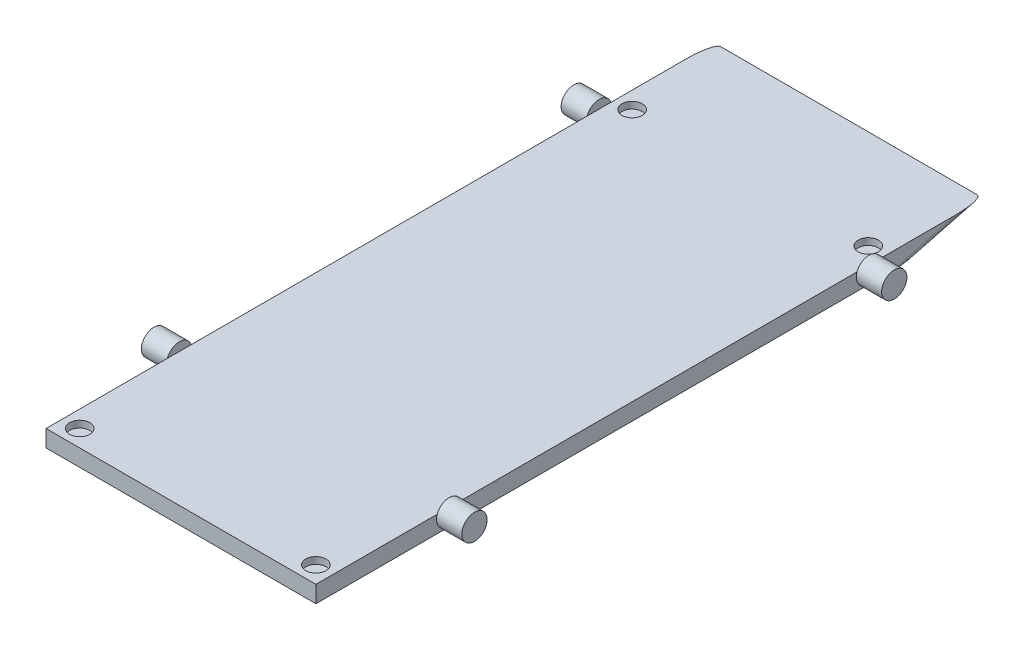
ISO-10303-21;
HEADER;
FILE_DESCRIPTION(('STEP AP214'),'2;1');
FILE_NAME('part.step','',(''),(''),'','','');
FILE_SCHEMA(('AUTOMOTIVE_DESIGN { 1 0 10303 214 1 1 1 1 }'));
ENDSEC;
DATA;
#1=APPLICATION_CONTEXT('core data for automotive mechanical design processes');
#2=APPLICATION_PROTOCOL_DEFINITION('international standard','automotive_design',2000,#1);
#3=PRODUCT_CONTEXT('',#1,'mechanical');
#4=PRODUCT('Part','Part','',(#3));
#5=PRODUCT_RELATED_PRODUCT_CATEGORY('part','',(#4));
#6=PRODUCT_DEFINITION_FORMATION('','',#4);
#7=PRODUCT_DEFINITION_CONTEXT('part definition',#1,'design');
#8=PRODUCT_DEFINITION('design','',#6,#7);
#9=PRODUCT_DEFINITION_SHAPE('','',#8);
#10=(LENGTH_UNIT() NAMED_UNIT(*) SI_UNIT(.MILLI.,.METRE.));
#11=(NAMED_UNIT(*) PLANE_ANGLE_UNIT() SI_UNIT($,.RADIAN.));
#12=(NAMED_UNIT(*) SI_UNIT($,.STERADIAN.) SOLID_ANGLE_UNIT());
#13=UNCERTAINTY_MEASURE_WITH_UNIT(LENGTH_MEASURE(1.E-05),#10,'distance_accuracy_value','');
#14=(GEOMETRIC_REPRESENTATION_CONTEXT(3) GLOBAL_UNCERTAINTY_ASSIGNED_CONTEXT((#13)) GLOBAL_UNIT_ASSIGNED_CONTEXT((#10,
#11,#12)) REPRESENTATION_CONTEXT('',''));
#15=CARTESIAN_POINT('',(0.,0.,0.));
#16=DIRECTION('',(0.,0.,1.));
#17=DIRECTION('',(1.,0.,0.));
#18=AXIS2_PLACEMENT_3D('',#15,#16,#17);
#19=CARTESIAN_POINT('',(40.,5.,-99.));
#20=DIRECTION('',(-1.,0.,0.));
#21=DIRECTION('',(0.,0.,1.));
#22=AXIS2_PLACEMENT_3D('',#19,#20,#21);
#23=PLANE('',#22);
#24=DIRECTION('',(0.,0.,-1.));
#25=VECTOR('',#24,1.);
#26=CARTESIAN_POINT('',(40.,5.,-99.));
#27=LINE('',#26,#25);
#28=CARTESIAN_POINT('',(40.,5.,55.9644660940673));
#29=VERTEX_POINT('',#28);
#30=CARTESIAN_POINT('',(40.,5.,-61.3933719084473));
#31=VERTEX_POINT('',#30);
#32=EDGE_CURVE('E205',#29,#31,#27,.T.);
#33=ORIENTED_EDGE('',*,*,#32,.F.);
#34=CARTESIAN_POINT('',(40.,3.75,59.5));
#35=DIRECTION('',(-1.,0.,0.));
#36=DIRECTION('',(0.,0.,1.));
#37=AXIS2_PLACEMENT_3D('',#34,#35,#36);
#38=CIRCLE('',#37,3.74999999999999);
#39=CARTESIAN_POINT('',(40.,0.,59.5));
#40=VERTEX_POINT('',#39);
#41=EDGE_CURVE('E184',#29,#40,#38,.T.);
#42=ORIENTED_EDGE('',*,*,#41,.T.);
#43=DIRECTION('',(0.,0.,-1.));
#44=VECTOR('',#43,1.);
#45=CARTESIAN_POINT('',(40.,0.,-99.));
#46=LINE('',#45,#44);
#47=CARTESIAN_POINT('',(40.,0.,-64.92890581438));
#48=VERTEX_POINT('',#47);
#49=EDGE_CURVE('E286',#40,#48,#46,.T.);
#50=ORIENTED_EDGE('',*,*,#49,.T.);
#51=CARTESIAN_POINT('',(40.,3.75,-64.92890581438));
#52=DIRECTION('',(-1.,0.,0.));
#53=DIRECTION('',(0.,0.,1.));
#54=AXIS2_PLACEMENT_3D('',#51,#52,#53);
#55=CIRCLE('',#54,3.75000000000001);
#56=EDGE_CURVE('E334',#48,#31,#55,.T.);
#57=ORIENTED_EDGE('',*,*,#56,.T.);
#58=EDGE_LOOP('',(#33,#42,#50,#57));
#59=FACE_BOUND('',#58,.T.);
#60=ADVANCED_FACE('F78',(#59),#23,.F.);
#61=CARTESIAN_POINT('',(40.,0.,-71.7485632957322));
#62=VERTEX_POINT('',#61);
#63=EDGE_CURVE('E279',#48,#62,#46,.T.);
#64=ORIENTED_EDGE('',*,*,#63,.T.);
#65=DIRECTION('',(0.,0.250993863675924,-0.967988677824814));
#66=VECTOR('',#65,1.);
#67=CARTESIAN_POINT('',(40.,6.93597735564963,-98.4980122726482));
#68=LINE('',#67,#66);
#69=CARTESIAN_POINT('',(40.,5.,-91.0316777043508));
#70=VERTEX_POINT('',#69);
#71=EDGE_CURVE('E251',#62,#70,#68,.T.);
#72=ORIENTED_EDGE('',*,*,#71,.T.);
#73=CARTESIAN_POINT('',(40.,5.,-68.4644397203128));
#74=VERTEX_POINT('',#73);
#75=EDGE_CURVE('E215',#74,#70,#27,.T.);
#76=ORIENTED_EDGE('',*,*,#75,.F.);
#77=EDGE_CURVE('E252',#74,#48,#55,.T.);
#78=ORIENTED_EDGE('',*,*,#77,.T.);
#79=EDGE_LOOP('',(#64,#72,#76,#78));
#80=FACE_BOUND('',#79,.T.);
#81=ADVANCED_FACE('F284',(#80),#23,.F.);
#82=CARTESIAN_POINT('',(-40.,5.,-99.));
#83=DIRECTION('',(1.,0.,0.));
#84=DIRECTION('',(0.,0.,-1.));
#85=AXIS2_PLACEMENT_3D('',#82,#83,#84);
#86=PLANE('',#85);
#87=CARTESIAN_POINT('',(-40.,3.75,-64.92890581438));
#88=DIRECTION('',(-1.,0.,0.));
#89=DIRECTION('',(0.,0.,1.));
#90=AXIS2_PLACEMENT_3D('',#87,#88,#89);
#91=CIRCLE('',#90,3.75000000000001);
#92=CARTESIAN_POINT('',(-40.,0.,-64.92890581438));
#93=VERTEX_POINT('',#92);
#94=CARTESIAN_POINT('',(-40.,5.,-61.3933719084473));
#95=VERTEX_POINT('',#94);
#96=EDGE_CURVE('E364',#93,#95,#91,.T.);
#97=ORIENTED_EDGE('',*,*,#96,.F.);
#98=DIRECTION('',(0.,0.,1.));
#99=VECTOR('',#98,1.);
#100=CARTESIAN_POINT('',(-40.,0.,-99.));
#101=LINE('',#100,#99);
#102=CARTESIAN_POINT('',(-40.,0.,59.5));
#103=VERTEX_POINT('',#102);
#104=EDGE_CURVE('E236',#93,#103,#101,.T.);
#105=ORIENTED_EDGE('',*,*,#104,.T.);
#106=CARTESIAN_POINT('',(-40.,3.75,59.5));
#107=DIRECTION('',(-1.,0.,0.));
#108=DIRECTION('',(0.,0.,1.));
#109=AXIS2_PLACEMENT_3D('',#106,#107,#108);
#110=CIRCLE('',#109,3.74999999999999);
#111=CARTESIAN_POINT('',(-40.,5.,55.9644660940673));
#112=VERTEX_POINT('',#111);
#113=EDGE_CURVE('E341',#112,#103,#110,.T.);
#114=ORIENTED_EDGE('',*,*,#113,.F.);
#115=DIRECTION('',(0.,0.,1.));
#116=VECTOR('',#115,1.);
#117=CARTESIAN_POINT('',(-40.,5.,-99.));
#118=LINE('',#117,#116);
#119=EDGE_CURVE('E301',#95,#112,#118,.T.);
#120=ORIENTED_EDGE('',*,*,#119,.F.);
#121=EDGE_LOOP('',(#97,#105,#114,#120));
#122=FACE_BOUND('',#121,.T.);
#123=ADVANCED_FACE('F432',(#122),#86,.F.);
#124=CARTESIAN_POINT('',(-40.,5.,-91.0316777043508));
#125=VERTEX_POINT('',#124);
#126=CARTESIAN_POINT('',(-40.,5.,-68.4644397203128));
#127=VERTEX_POINT('',#126);
#128=EDGE_CURVE('E294',#125,#127,#118,.T.);
#129=ORIENTED_EDGE('',*,*,#128,.F.);
#130=DIRECTION('',(0.,0.250993863675924,-0.967988677824814));
#131=VECTOR('',#130,1.);
#132=CARTESIAN_POINT('',(-40.,6.93597735564963,-98.4980122726482));
#133=LINE('',#132,#131);
#134=CARTESIAN_POINT('',(-40.,0.,-71.7485632957322));
#135=VERTEX_POINT('',#134);
#136=EDGE_CURVE('E12',#125,#135,#133,.F.);
#137=ORIENTED_EDGE('',*,*,#136,.T.);
#138=EDGE_CURVE('E228',#135,#93,#101,.T.);
#139=ORIENTED_EDGE('',*,*,#138,.T.);
#140=EDGE_CURVE('E299',#127,#93,#91,.T.);
#141=ORIENTED_EDGE('',*,*,#140,.F.);
#142=EDGE_LOOP('',(#129,#137,#139,#141));
#143=FACE_BOUND('',#142,.T.);
#144=ADVANCED_FACE('F297',(#143),#86,.F.);
#145=CARTESIAN_POINT('',(40.,0.,99.));
#146=VERTEX_POINT('',#145);
#147=EDGE_CURVE('E195',#146,#40,#46,.T.);
#148=ORIENTED_EDGE('',*,*,#147,.T.);
#149=CARTESIAN_POINT('',(40.,5.,63.0355339059327));
#150=VERTEX_POINT('',#149);
#151=EDGE_CURVE('E182',#40,#150,#38,.T.);
#152=ORIENTED_EDGE('',*,*,#151,.T.);
#153=CARTESIAN_POINT('',(40.,5.,99.));
#154=VERTEX_POINT('',#153);
#155=EDGE_CURVE('E193',#154,#150,#27,.T.);
#156=ORIENTED_EDGE('',*,*,#155,.F.);
#157=DIRECTION('',(0.,-1.,0.));
#158=VECTOR('',#157,1.);
#159=CARTESIAN_POINT('',(40.,5.,99.));
#160=LINE('',#159,#158);
#161=EDGE_CURVE('E241',#154,#146,#160,.T.);
#162=ORIENTED_EDGE('',*,*,#161,.T.);
#163=EDGE_LOOP('',(#148,#152,#156,#162));
#164=FACE_BOUND('',#163,.T.);
#165=ADVANCED_FACE('F191',(#164),#23,.F.);
#166=CARTESIAN_POINT('',(-40.,5.,63.0355339059327));
#167=VERTEX_POINT('',#166);
#168=EDGE_CURVE('E247',#103,#167,#110,.T.);
#169=ORIENTED_EDGE('',*,*,#168,.F.);
#170=CARTESIAN_POINT('',(-40.,0.,99.));
#171=VERTEX_POINT('',#170);
#172=EDGE_CURVE('E238',#103,#171,#101,.T.);
#173=ORIENTED_EDGE('',*,*,#172,.T.);
#174=DIRECTION('',(0.,-1.,0.));
#175=VECTOR('',#174,1.);
#176=CARTESIAN_POINT('',(-40.,5.,99.));
#177=LINE('',#176,#175);
#178=CARTESIAN_POINT('',(-40.,5.,99.));
#179=VERTEX_POINT('',#178);
#180=EDGE_CURVE('E244',#179,#171,#177,.T.);
#181=ORIENTED_EDGE('',*,*,#180,.F.);
#182=EDGE_CURVE('E213',#167,#179,#118,.T.);
#183=ORIENTED_EDGE('',*,*,#182,.F.);
#184=EDGE_LOOP('',(#169,#173,#181,#183));
#185=FACE_BOUND('',#184,.T.);
#186=ADVANCED_FACE('F321',(#185),#86,.F.);
#187=CARTESIAN_POINT('',(-40.,5.,99.));
#188=DIRECTION('',(0.,0.,-1.));
#189=DIRECTION('',(-1.,0.,0.));
#190=AXIS2_PLACEMENT_3D('',#187,#188,#189);
#191=PLANE('',#190);
#192=DIRECTION('',(1.,0.,0.));
#193=VECTOR('',#192,1.);
#194=CARTESIAN_POINT('',(-40.,0.,99.));
#195=LINE('',#194,#193);
#196=EDGE_CURVE('E223',#171,#146,#195,.T.);
#197=ORIENTED_EDGE('',*,*,#196,.T.);
#198=ORIENTED_EDGE('',*,*,#161,.F.);
#199=DIRECTION('',(1.,0.,0.));
#200=VECTOR('',#199,1.);
#201=CARTESIAN_POINT('',(-40.,5.,99.));
#202=LINE('',#201,#200);
#203=EDGE_CURVE('E201',#179,#154,#202,.T.);
#204=ORIENTED_EDGE('',*,*,#203,.F.);
#205=ORIENTED_EDGE('',*,*,#180,.T.);
#206=EDGE_LOOP('',(#197,#198,#204,#205));
#207=FACE_BOUND('',#206,.T.);
#208=ADVANCED_FACE('F323',(#207),#191,.F.);
#209=CARTESIAN_POINT('',(0.,5.,0.));
#210=DIRECTION('',(0.,1.,0.));
#211=DIRECTION('',(0.,0.,1.));
#212=AXIS2_PLACEMENT_3D('',#209,#210,#211);
#213=PLANE('',#212);
#214=CARTESIAN_POINT('',(35.,5.,-69.7168855913814));
#215=DIRECTION('',(0.,1.,0.));
#216=DIRECTION('',(0.,0.,1.));
#217=AXIS2_PLACEMENT_3D('',#214,#215,#216);
#218=CIRCLE('',#217,3.);
#219=CARTESIAN_POINT('',(35.,5.,-66.7168855913814));
#220=VERTEX_POINT('',#219);
#221=EDGE_CURVE('E374',#220,#220,#218,.T.);
#222=ORIENTED_EDGE('',*,*,#221,.F.);
#223=EDGE_LOOP('',(#222));
#224=FACE_BOUND('',#223,.T.);
#225=CARTESIAN_POINT('',(-35.,5.,94.));
#226=DIRECTION('',(0.,1.,0.));
#227=DIRECTION('',(0.,0.,1.));
#228=AXIS2_PLACEMENT_3D('',#225,#226,#227);
#229=CIRCLE('',#228,3.);
#230=CARTESIAN_POINT('',(-35.,5.,97.));
#231=VERTEX_POINT('',#230);
#232=EDGE_CURVE('E382',#231,#231,#229,.T.);
#233=ORIENTED_EDGE('',*,*,#232,.F.);
#234=EDGE_LOOP('',(#233));
#235=FACE_BOUND('',#234,.T.);
#236=CARTESIAN_POINT('',(35.,5.,94.));
#237=DIRECTION('',(0.,1.,0.));
#238=DIRECTION('',(0.,0.,1.));
#239=AXIS2_PLACEMENT_3D('',#236,#237,#238);
#240=CIRCLE('',#239,3.);
#241=CARTESIAN_POINT('',(35.,5.,97.));
#242=VERTEX_POINT('',#241);
#243=EDGE_CURVE('E383',#242,#242,#240,.T.);
#244=ORIENTED_EDGE('',*,*,#243,.F.);
#245=EDGE_LOOP('',(#244));
#246=FACE_BOUND('',#245,.T.);
#247=CARTESIAN_POINT('',(-35.,5.,-69.7168855913814));
#248=DIRECTION('',(0.,1.,0.));
#249=DIRECTION('',(0.,0.,1.));
#250=AXIS2_PLACEMENT_3D('',#247,#248,#249);
#251=CIRCLE('',#250,3.);
#252=CARTESIAN_POINT('',(-35.,5.,-66.7168855913814));
#253=VERTEX_POINT('',#252);
#254=EDGE_CURVE('E370',#253,#253,#251,.T.);
#255=ORIENTED_EDGE('',*,*,#254,.F.);
#256=EDGE_LOOP('',(#255));
#257=FACE_BOUND('',#256,.T.);
#258=ORIENTED_EDGE('',*,*,#75,.T.);
#259=CARTESIAN_POINT('',(38.,5.,-91.0316777043508));
#260=DIRECTION('',(0.,1.,0.));
#261=DIRECTION('',(0.,0.,-1.));
#262=AXIS2_PLACEMENT_3D('',#259,#260,#261);
#263=ELLIPSE('',#262,7.9683222956492,2.);
#264=CARTESIAN_POINT('',(38.,5.,-99.));
#265=VERTEX_POINT('',#264);
#266=EDGE_CURVE('E259',#70,#265,#263,.T.);
#267=ORIENTED_EDGE('',*,*,#266,.T.);
#268=DIRECTION('',(-1.,0.,0.));
#269=VECTOR('',#268,1.);
#270=CARTESIAN_POINT('',(-40.,5.,-99.));
#271=LINE('',#270,#269);
#272=CARTESIAN_POINT('',(-38.,5.,-99.));
#273=VERTEX_POINT('',#272);
#274=EDGE_CURVE('E204',#265,#273,#271,.T.);
#275=ORIENTED_EDGE('',*,*,#274,.T.);
#276=CARTESIAN_POINT('',(-38.,5.,-91.0316777043508));
#277=DIRECTION('',(0.,1.,0.));
#278=DIRECTION('',(0.,0.,-1.));
#279=AXIS2_PLACEMENT_3D('',#276,#277,#278);
#280=ELLIPSE('',#279,7.9683222956492,2.);
#281=EDGE_CURVE('E256',#273,#125,#280,.T.);
#282=ORIENTED_EDGE('',*,*,#281,.T.);
#283=ORIENTED_EDGE('',*,*,#128,.T.);
#284=DIRECTION('',(0.,0.,1.));
#285=VECTOR('',#284,1.);
#286=CARTESIAN_POINT('',(-40.,5.,0.));
#287=LINE('',#286,#285);
#288=EDGE_CURVE('E743',#127,#95,#287,.T.);
#289=ORIENTED_EDGE('',*,*,#288,.T.);
#290=ORIENTED_EDGE('',*,*,#119,.T.);
#291=EDGE_CURVE('E303',#112,#167,#118,.T.);
#292=ORIENTED_EDGE('',*,*,#291,.T.);
#293=ORIENTED_EDGE('',*,*,#182,.T.);
#294=ORIENTED_EDGE('',*,*,#203,.T.);
#295=ORIENTED_EDGE('',*,*,#155,.T.);
#296=DIRECTION('',(0.,0.,-1.));
#297=VECTOR('',#296,1.);
#298=CARTESIAN_POINT('',(40.,5.,0.));
#299=LINE('',#298,#297);
#300=EDGE_CURVE('E168',#150,#29,#299,.T.);
#301=ORIENTED_EDGE('',*,*,#300,.T.);
#302=ORIENTED_EDGE('',*,*,#32,.T.);
#303=EDGE_CURVE('E207',#31,#74,#27,.T.);
#304=ORIENTED_EDGE('',*,*,#303,.T.);
#305=EDGE_LOOP('',(#258,#267,#275,#282,#283,#289,#290,#292,#293,#294,#295,#301,#302,#304));
#306=FACE_BOUND('',#305,.T.);
#307=ADVANCED_FACE('F199',(#224,#235,#246,#257,#306),#213,.T.);
#308=CARTESIAN_POINT('',(0.,0.,0.));
#309=DIRECTION('',(0.,1.,0.));
#310=DIRECTION('',(0.,0.,1.));
#311=AXIS2_PLACEMENT_3D('',#308,#309,#310);
#312=PLANE('',#311);
#313=DIRECTION('',(1.,0.,0.));
#314=VECTOR('',#313,1.);
#315=CARTESIAN_POINT('',(0.,0.,-79.7168855913814));
#316=LINE('',#315,#314);
#317=CARTESIAN_POINT('',(-38.,0.,-79.7168855913814));
#318=VERTEX_POINT('',#317);
#319=CARTESIAN_POINT('',(38.,0.,-79.7168855913814));
#320=VERTEX_POINT('',#319);
#321=EDGE_CURVE('E248',#318,#320,#316,.T.);
#322=ORIENTED_EDGE('',*,*,#321,.T.);
#323=CARTESIAN_POINT('',(38.,0.,-71.7485632957322));
#324=DIRECTION('',(0.,1.,0.));
#325=DIRECTION('',(0.,0.,-1.));
#326=AXIS2_PLACEMENT_3D('',#323,#324,#325);
#327=ELLIPSE('',#326,7.9683222956492,2.);
#328=EDGE_CURVE('E87',#320,#62,#327,.F.);
#329=ORIENTED_EDGE('',*,*,#328,.T.);
#330=ORIENTED_EDGE('',*,*,#63,.F.);
#331=ORIENTED_EDGE('',*,*,#49,.F.);
#332=ORIENTED_EDGE('',*,*,#147,.F.);
#333=ORIENTED_EDGE('',*,*,#196,.F.);
#334=ORIENTED_EDGE('',*,*,#172,.F.);
#335=ORIENTED_EDGE('',*,*,#104,.F.);
#336=ORIENTED_EDGE('',*,*,#138,.F.);
#337=CARTESIAN_POINT('',(-38.,0.,-71.7485632957322));
#338=DIRECTION('',(0.,1.,0.));
#339=DIRECTION('',(0.,0.,-1.));
#340=AXIS2_PLACEMENT_3D('',#337,#338,#339);
#341=ELLIPSE('',#340,7.9683222956492,2.);
#342=EDGE_CURVE('E268',#135,#318,#341,.F.);
#343=ORIENTED_EDGE('',*,*,#342,.T.);
#344=EDGE_LOOP('',(#322,#329,#330,#331,#332,#333,#334,#335,#336,#343));
#345=FACE_BOUND('',#344,.T.);
#346=ADVANCED_FACE('F277',(#345),#312,.F.);
#347=CARTESIAN_POINT('',(-40.,0.,0.));
#348=DIRECTION('',(-1.,0.,0.));
#349=DIRECTION('',(0.,0.,1.));
#350=AXIS2_PLACEMENT_3D('',#347,#348,#349);
#351=PLANE('',#350);
#352=ORIENTED_EDGE('',*,*,#291,.F.);
#353=EDGE_CURVE('E348',#167,#112,#110,.T.);
#354=ORIENTED_EDGE('',*,*,#353,.F.);
#355=EDGE_LOOP('',(#352,#354));
#356=FACE_BOUND('',#355,.T.);
#357=ADVANCED_FACE('F447',(#356),#351,.F.);
#358=CARTESIAN_POINT('',(-47.5,3.75,59.5));
#359=DIRECTION('',(1.,0.,0.));
#360=DIRECTION('',(0.,0.,-1.));
#361=AXIS2_PLACEMENT_3D('',#358,#359,#360);
#362=CYLINDRICAL_SURFACE('',#361,3.74999999999999);
#363=CARTESIAN_POINT('',(-47.5,3.75,59.5));
#364=DIRECTION('',(-1.,0.,0.));
#365=DIRECTION('',(0.,0.,1.));
#366=AXIS2_PLACEMENT_3D('',#363,#364,#365);
#367=CIRCLE('',#366,3.74999999999999);
#368=CARTESIAN_POINT('',(-47.5,3.75,63.25));
#369=VERTEX_POINT('',#368);
#370=EDGE_CURVE('E287',#369,#369,#367,.T.);
#371=ORIENTED_EDGE('',*,*,#370,.F.);
#372=EDGE_LOOP('',(#371));
#373=FACE_BOUND('',#372,.T.);
#374=ORIENTED_EDGE('',*,*,#353,.T.);
#375=ORIENTED_EDGE('',*,*,#113,.T.);
#376=ORIENTED_EDGE('',*,*,#168,.T.);
#377=EDGE_LOOP('',(#374,#375,#376));
#378=FACE_BOUND('',#377,.T.);
#379=ADVANCED_FACE('F448',(#373,#378),#362,.T.);
#380=CARTESIAN_POINT('',(-47.5,0.,0.));
#381=DIRECTION('',(-1.,0.,0.));
#382=DIRECTION('',(0.,0.,1.));
#383=AXIS2_PLACEMENT_3D('',#380,#381,#382);
#384=PLANE('',#383);
#385=ORIENTED_EDGE('',*,*,#370,.T.);
#386=EDGE_LOOP('',(#385));
#387=FACE_BOUND('',#386,.T.);
#388=ADVANCED_FACE('F452',(#387),#384,.T.);
#389=CARTESIAN_POINT('',(-40.,0.,0.));
#390=DIRECTION('',(-1.,0.,0.));
#391=DIRECTION('',(0.,0.,1.));
#392=AXIS2_PLACEMENT_3D('',#389,#390,#391);
#393=PLANE('',#392);
#394=ORIENTED_EDGE('',*,*,#288,.F.);
#395=EDGE_CURVE('E738',#95,#127,#91,.T.);
#396=ORIENTED_EDGE('',*,*,#395,.F.);
#397=EDGE_LOOP('',(#394,#396));
#398=FACE_BOUND('',#397,.T.);
#399=ADVANCED_FACE('F459',(#398),#393,.F.);
#400=CARTESIAN_POINT('',(-47.5,3.75,-64.92890581438));
#401=DIRECTION('',(1.,0.,0.));
#402=DIRECTION('',(0.,0.,-1.));
#403=AXIS2_PLACEMENT_3D('',#400,#401,#402);
#404=CYLINDRICAL_SURFACE('',#403,3.75000000000001);
#405=ORIENTED_EDGE('',*,*,#395,.T.);
#406=ORIENTED_EDGE('',*,*,#140,.T.);
#407=ORIENTED_EDGE('',*,*,#96,.T.);
#408=EDGE_LOOP('',(#405,#406,#407));
#409=FACE_BOUND('',#408,.T.);
#410=CARTESIAN_POINT('',(-47.5,3.75,-64.92890581438));
#411=DIRECTION('',(-1.,0.,0.));
#412=DIRECTION('',(0.,0.,1.));
#413=AXIS2_PLACEMENT_3D('',#410,#411,#412);
#414=CIRCLE('',#413,3.75000000000001);
#415=CARTESIAN_POINT('',(-47.5,3.75,-61.17890581438));
#416=VERTEX_POINT('',#415);
#417=EDGE_CURVE('E358',#416,#416,#414,.T.);
#418=ORIENTED_EDGE('',*,*,#417,.F.);
#419=EDGE_LOOP('',(#418));
#420=FACE_BOUND('',#419,.T.);
#421=ADVANCED_FACE('F461',(#409,#420),#404,.T.);
#422=CARTESIAN_POINT('',(-47.5,0.,0.));
#423=DIRECTION('',(-1.,0.,0.));
#424=DIRECTION('',(0.,0.,1.));
#425=AXIS2_PLACEMENT_3D('',#422,#423,#424);
#426=PLANE('',#425);
#427=ORIENTED_EDGE('',*,*,#417,.T.);
#428=EDGE_LOOP('',(#427));
#429=FACE_BOUND('',#428,.T.);
#430=ADVANCED_FACE('F462',(#429),#426,.T.);
#431=CARTESIAN_POINT('',(47.5,3.75,-64.92890581438));
#432=DIRECTION('',(-1.,0.,0.));
#433=DIRECTION('',(0.,0.,1.));
#434=AXIS2_PLACEMENT_3D('',#431,#432,#433);
#435=CYLINDRICAL_SURFACE('',#434,3.75000000000001);
#436=EDGE_CURVE('E176',#31,#74,#55,.T.);
#437=ORIENTED_EDGE('',*,*,#436,.F.);
#438=ORIENTED_EDGE('',*,*,#56,.F.);
#439=ORIENTED_EDGE('',*,*,#77,.F.);
#440=EDGE_LOOP('',(#437,#438,#439));
#441=FACE_BOUND('',#440,.T.);
#442=CARTESIAN_POINT('',(47.5,3.75,-64.92890581438));
#443=DIRECTION('',(-1.,0.,0.));
#444=DIRECTION('',(0.,0.,1.));
#445=AXIS2_PLACEMENT_3D('',#442,#443,#444);
#446=CIRCLE('',#445,3.75000000000001);
#447=CARTESIAN_POINT('',(47.5,3.75,-61.17890581438));
#448=VERTEX_POINT('',#447);
#449=EDGE_CURVE('E352',#448,#448,#446,.T.);
#450=ORIENTED_EDGE('',*,*,#449,.T.);
#451=EDGE_LOOP('',(#450));
#452=FACE_BOUND('',#451,.T.);
#453=ADVANCED_FACE('F337',(#441,#452),#435,.T.);
#454=CARTESIAN_POINT('',(47.5,0.,0.));
#455=DIRECTION('',(1.,0.,0.));
#456=DIRECTION('',(0.,0.,1.));
#457=AXIS2_PLACEMENT_3D('',#454,#455,#456);
#458=PLANE('',#457);
#459=ORIENTED_EDGE('',*,*,#449,.F.);
#460=EDGE_LOOP('',(#459));
#461=FACE_BOUND('',#460,.T.);
#462=ADVANCED_FACE('F472',(#461),#458,.T.);
#463=CARTESIAN_POINT('',(40.,0.,0.));
#464=DIRECTION('',(1.,0.,0.));
#465=DIRECTION('',(0.,0.,1.));
#466=AXIS2_PLACEMENT_3D('',#463,#464,#465);
#467=PLANE('',#466);
#468=ORIENTED_EDGE('',*,*,#303,.F.);
#469=ORIENTED_EDGE('',*,*,#436,.T.);
#470=EDGE_LOOP('',(#468,#469));
#471=FACE_BOUND('',#470,.T.);
#472=ADVANCED_FACE('F473',(#471),#467,.F.);
#473=CARTESIAN_POINT('',(47.5,3.75,59.5));
#474=DIRECTION('',(-1.,0.,0.));
#475=DIRECTION('',(0.,0.,1.));
#476=AXIS2_PLACEMENT_3D('',#473,#474,#475);
#477=CYLINDRICAL_SURFACE('',#476,3.74999999999999);
#478=CARTESIAN_POINT('',(47.5,3.75,59.5));
#479=DIRECTION('',(-1.,0.,0.));
#480=DIRECTION('',(0.,0.,1.));
#481=AXIS2_PLACEMENT_3D('',#478,#479,#480);
#482=CIRCLE('',#481,3.74999999999999);
#483=CARTESIAN_POINT('',(47.5,3.75,63.25));
#484=VERTEX_POINT('',#483);
#485=EDGE_CURVE('E177',#484,#484,#482,.T.);
#486=ORIENTED_EDGE('',*,*,#485,.T.);
#487=EDGE_LOOP('',(#486));
#488=FACE_BOUND('',#487,.T.);
#489=EDGE_CURVE('E171',#150,#29,#38,.T.);
#490=ORIENTED_EDGE('',*,*,#489,.F.);
#491=ORIENTED_EDGE('',*,*,#151,.F.);
#492=ORIENTED_EDGE('',*,*,#41,.F.);
#493=EDGE_LOOP('',(#490,#491,#492));
#494=FACE_BOUND('',#493,.T.);
#495=ADVANCED_FACE('F181',(#488,#494),#477,.T.);
#496=CARTESIAN_POINT('',(47.5,0.,0.));
#497=DIRECTION('',(1.,0.,0.));
#498=DIRECTION('',(0.,0.,1.));
#499=AXIS2_PLACEMENT_3D('',#496,#497,#498);
#500=PLANE('',#499);
#501=ORIENTED_EDGE('',*,*,#485,.F.);
#502=EDGE_LOOP('',(#501));
#503=FACE_BOUND('',#502,.T.);
#504=ADVANCED_FACE('F481',(#503),#500,.T.);
#505=CARTESIAN_POINT('',(40.,0.,0.));
#506=DIRECTION('',(1.,0.,0.));
#507=DIRECTION('',(0.,0.,1.));
#508=AXIS2_PLACEMENT_3D('',#505,#506,#507);
#509=PLANE('',#508);
#510=ORIENTED_EDGE('',*,*,#300,.F.);
#511=ORIENTED_EDGE('',*,*,#489,.T.);
#512=EDGE_LOOP('',(#510,#511));
#513=FACE_BOUND('',#512,.T.);
#514=ADVANCED_FACE('F170',(#513),#509,.F.);
#515=CARTESIAN_POINT('',(47.5,5.,-99.));
#516=DIRECTION('',(0.,0.967988677824814,0.250993863675924));
#517=DIRECTION('',(0.,-0.250993863675924,0.967988677824814));
#518=AXIS2_PLACEMENT_3D('',#515,#516,#517);
#519=PLANE('',#518);
#520=ORIENTED_EDGE('',*,*,#274,.F.);
#521=DIRECTION('',(0.,0.250993863675924,-0.967988677824814));
#522=VECTOR('',#521,1.);
#523=CARTESIAN_POINT('',(38.,5.,-99.));
#524=LINE('',#523,#522);
#525=EDGE_CURVE('E100',#265,#320,#524,.F.);
#526=ORIENTED_EDGE('',*,*,#525,.T.);
#527=ORIENTED_EDGE('',*,*,#321,.F.);
#528=DIRECTION('',(0.,0.250993863675924,-0.967988677824814));
#529=VECTOR('',#528,1.);
#530=CARTESIAN_POINT('',(-38.,5.,-99.));
#531=LINE('',#530,#529);
#532=EDGE_CURVE('E262',#318,#273,#531,.T.);
#533=ORIENTED_EDGE('',*,*,#532,.T.);
#534=EDGE_LOOP('',(#520,#526,#527,#533));
#535=FACE_BOUND('',#534,.T.);
#536=ADVANCED_FACE('F289',(#535),#519,.F.);
#537=CARTESIAN_POINT('',(38.,6.93597735564963,-98.4980122726482));
#538=DIRECTION('',(0.,0.250993863675924,-0.967988677824814));
#539=DIRECTION('',(0.,0.967988677824814,0.250993863675924));
#540=AXIS2_PLACEMENT_3D('',#537,#538,#539);
#541=CYLINDRICAL_SURFACE('',#540,2.);
#542=ORIENTED_EDGE('',*,*,#328,.F.);
#543=ORIENTED_EDGE('',*,*,#525,.F.);
#544=ORIENTED_EDGE('',*,*,#266,.F.);
#545=ORIENTED_EDGE('',*,*,#71,.F.);
#546=EDGE_LOOP('',(#542,#543,#544,#545));
#547=FACE_BOUND('',#546,.T.);
#548=ADVANCED_FACE('F288',(#547),#541,.T.);
#549=CARTESIAN_POINT('',(-38.,6.93597735564963,-98.4980122726482));
#550=DIRECTION('',(0.,0.250993863675924,-0.967988677824814));
#551=DIRECTION('',(0.,0.967988677824814,0.250993863675924));
#552=AXIS2_PLACEMENT_3D('',#549,#550,#551);
#553=CYLINDRICAL_SURFACE('',#552,2.);
#554=ORIENTED_EDGE('',*,*,#342,.F.);
#555=ORIENTED_EDGE('',*,*,#136,.F.);
#556=ORIENTED_EDGE('',*,*,#281,.F.);
#557=ORIENTED_EDGE('',*,*,#532,.F.);
#558=EDGE_LOOP('',(#554,#555,#556,#557));
#559=FACE_BOUND('',#558,.T.);
#560=ADVANCED_FACE('F80',(#559),#553,.T.);
#561=CARTESIAN_POINT('',(-35.,3.,-69.7168855913814));
#562=DIRECTION('',(0.,1.,0.));
#563=DIRECTION('',(0.,0.,1.));
#564=AXIS2_PLACEMENT_3D('',#561,#562,#563);
#565=CYLINDRICAL_SURFACE('',#564,3.);
#566=CARTESIAN_POINT('',(-35.,3.,-69.7168855913814));
#567=DIRECTION('',(0.,1.,0.));
#568=DIRECTION('',(0.,0.,1.));
#569=AXIS2_PLACEMENT_3D('',#566,#567,#568);
#570=CIRCLE('',#569,3.);
#571=CARTESIAN_POINT('',(-35.,3.,-66.7168855913814));
#572=VERTEX_POINT('',#571);
#573=EDGE_CURVE('E197',#572,#572,#570,.T.);
#574=ORIENTED_EDGE('',*,*,#573,.F.);
#575=EDGE_LOOP('',(#574));
#576=FACE_BOUND('',#575,.T.);
#577=ORIENTED_EDGE('',*,*,#254,.T.);
#578=EDGE_LOOP('',(#577));
#579=FACE_BOUND('',#578,.T.);
#580=ADVANCED_FACE('F412',(#576,#579),#565,.F.);
#581=CARTESIAN_POINT('',(-35.,3.,-69.7168855913814));
#582=DIRECTION('',(0.,1.,0.));
#583=DIRECTION('',(0.,0.,1.));
#584=AXIS2_PLACEMENT_3D('',#581,#582,#583);
#585=PLANE('',#584);
#586=ORIENTED_EDGE('',*,*,#573,.T.);
#587=EDGE_LOOP('',(#586));
#588=FACE_BOUND('',#587,.T.);
#589=ADVANCED_FACE('F414',(#588),#585,.T.);
#590=CARTESIAN_POINT('',(35.,3.,94.));
#591=DIRECTION('',(0.,1.,0.));
#592=DIRECTION('',(0.,0.,1.));
#593=AXIS2_PLACEMENT_3D('',#590,#591,#592);
#594=CYLINDRICAL_SURFACE('',#593,3.);
#595=CARTESIAN_POINT('',(35.,3.,94.));
#596=DIRECTION('',(0.,1.,0.));
#597=DIRECTION('',(0.,0.,1.));
#598=AXIS2_PLACEMENT_3D('',#595,#596,#597);
#599=CIRCLE('',#598,3.);
#600=CARTESIAN_POINT('',(35.,3.,97.));
#601=VERTEX_POINT('',#600);
#602=EDGE_CURVE('E394',#601,#601,#599,.T.);
#603=ORIENTED_EDGE('',*,*,#602,.F.);
#604=EDGE_LOOP('',(#603));
#605=FACE_BOUND('',#604,.T.);
#606=ORIENTED_EDGE('',*,*,#243,.T.);
#607=EDGE_LOOP('',(#606));
#608=FACE_BOUND('',#607,.T.);
#609=ADVANCED_FACE('F404',(#605,#608),#594,.F.);
#610=CARTESIAN_POINT('',(35.,3.,94.));
#611=DIRECTION('',(0.,1.,0.));
#612=DIRECTION('',(0.,0.,1.));
#613=AXIS2_PLACEMENT_3D('',#610,#611,#612);
#614=PLANE('',#613);
#615=ORIENTED_EDGE('',*,*,#602,.T.);
#616=EDGE_LOOP('',(#615));
#617=FACE_BOUND('',#616,.T.);
#618=ADVANCED_FACE('F659',(#617),#614,.T.);
#619=CARTESIAN_POINT('',(-35.,3.,94.));
#620=DIRECTION('',(0.,1.,0.));
#621=DIRECTION('',(0.,0.,1.));
#622=AXIS2_PLACEMENT_3D('',#619,#620,#621);
#623=CYLINDRICAL_SURFACE('',#622,3.);
#624=CARTESIAN_POINT('',(-35.,3.,94.));
#625=DIRECTION('',(0.,1.,0.));
#626=DIRECTION('',(0.,0.,1.));
#627=AXIS2_PLACEMENT_3D('',#624,#625,#626);
#628=CIRCLE('',#627,3.);
#629=CARTESIAN_POINT('',(-35.,3.,97.));
#630=VERTEX_POINT('',#629);
#631=EDGE_CURVE('E378',#630,#630,#628,.T.);
#632=ORIENTED_EDGE('',*,*,#631,.F.);
#633=EDGE_LOOP('',(#632));
#634=FACE_BOUND('',#633,.T.);
#635=ORIENTED_EDGE('',*,*,#232,.T.);
#636=EDGE_LOOP('',(#635));
#637=FACE_BOUND('',#636,.T.);
#638=ADVANCED_FACE('F668',(#634,#637),#623,.F.);
#639=CARTESIAN_POINT('',(-35.,3.,94.));
#640=DIRECTION('',(0.,1.,0.));
#641=DIRECTION('',(0.,0.,1.));
#642=AXIS2_PLACEMENT_3D('',#639,#640,#641);
#643=PLANE('',#642);
#644=ORIENTED_EDGE('',*,*,#631,.T.);
#645=EDGE_LOOP('',(#644));
#646=FACE_BOUND('',#645,.T.);
#647=ADVANCED_FACE('F677',(#646),#643,.T.);
#648=CARTESIAN_POINT('',(35.,3.,-69.7168855913814));
#649=DIRECTION('',(0.,1.,0.));
#650=DIRECTION('',(0.,0.,1.));
#651=AXIS2_PLACEMENT_3D('',#648,#649,#650);
#652=CYLINDRICAL_SURFACE('',#651,3.);
#653=CARTESIAN_POINT('',(35.,3.,-69.7168855913814));
#654=DIRECTION('',(0.,1.,0.));
#655=DIRECTION('',(0.,0.,1.));
#656=AXIS2_PLACEMENT_3D('',#653,#654,#655);
#657=CIRCLE('',#656,3.);
#658=CARTESIAN_POINT('',(35.,3.,-66.7168855913814));
#659=VERTEX_POINT('',#658);
#660=EDGE_CURVE('E387',#659,#659,#657,.T.);
#661=ORIENTED_EDGE('',*,*,#660,.F.);
#662=EDGE_LOOP('',(#661));
#663=FACE_BOUND('',#662,.T.);
#664=ORIENTED_EDGE('',*,*,#221,.T.);
#665=EDGE_LOOP('',(#664));
#666=FACE_BOUND('',#665,.T.);
#667=ADVANCED_FACE('F686',(#663,#666),#652,.F.);
#668=CARTESIAN_POINT('',(35.,3.,-69.7168855913814));
#669=DIRECTION('',(0.,1.,0.));
#670=DIRECTION('',(0.,0.,1.));
#671=AXIS2_PLACEMENT_3D('',#668,#669,#670);
#672=PLANE('',#671);
#673=ORIENTED_EDGE('',*,*,#660,.T.);
#674=EDGE_LOOP('',(#673));
#675=FACE_BOUND('',#674,.T.);
#676=ADVANCED_FACE('F695',(#675),#672,.T.);
#677=CLOSED_SHELL('',(#60,#81,#123,#144,#165,#186,#208,#307,#346,#357,#379,#388,#399,#421,#430,
#453,#462,#472,#495,#504,#514,#536,#548,#560,#580,#589,#609,#618,#638,#647,#667,#676));
#678=MANIFOLD_SOLID_BREP('B2',#677);
#679=ADVANCED_BREP_SHAPE_REPRESENTATION('',(#18,#678),#14);
#680=SHAPE_DEFINITION_REPRESENTATION(#9,#679);
ENDSEC;
END-ISO-10303-21;
